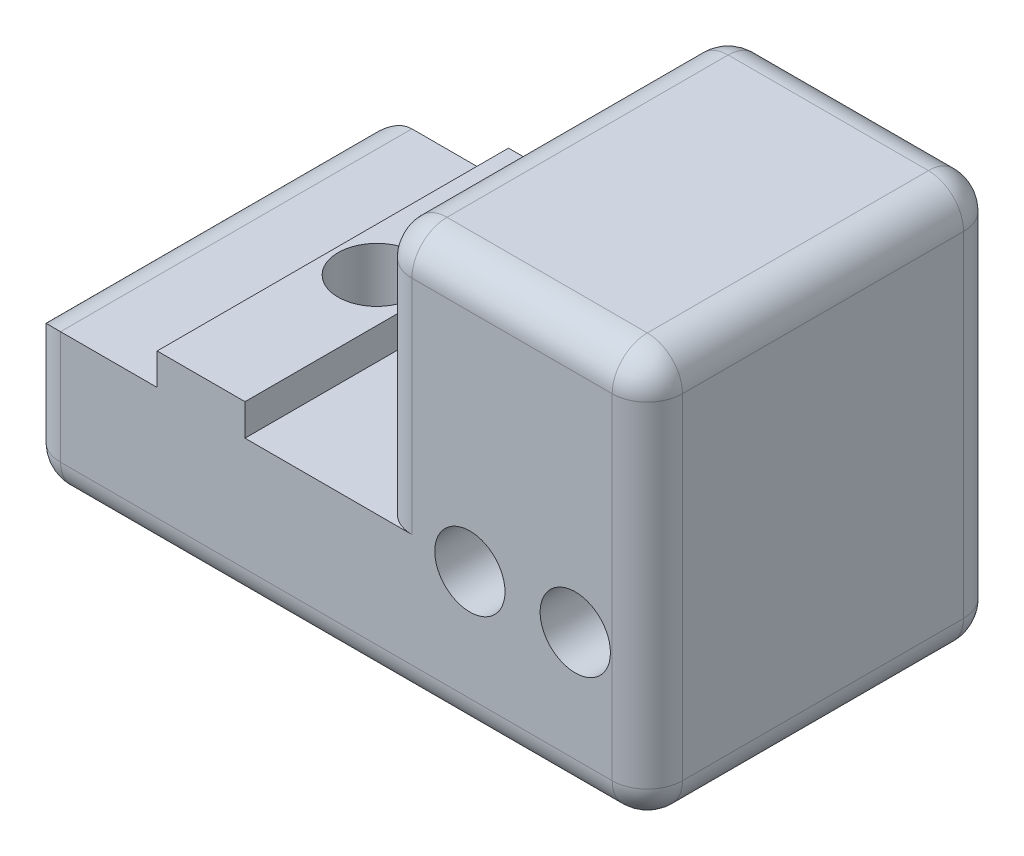
ISO-10303-21;
HEADER;
FILE_DESCRIPTION(('STEP AP214'),'2;1');
FILE_NAME('part.step','',(''),(''),'','','');
FILE_SCHEMA(('AUTOMOTIVE_DESIGN { 1 0 10303 214 1 1 1 1 }'));
ENDSEC;
DATA;
#1=APPLICATION_CONTEXT('core data for automotive mechanical design processes');
#2=APPLICATION_PROTOCOL_DEFINITION('international standard','automotive_design',2000,#1);
#3=PRODUCT_CONTEXT('',#1,'mechanical');
#4=PRODUCT('Part','Part','',(#3));
#5=PRODUCT_RELATED_PRODUCT_CATEGORY('part','',(#4));
#6=PRODUCT_DEFINITION_FORMATION('','',#4);
#7=PRODUCT_DEFINITION_CONTEXT('part definition',#1,'design');
#8=PRODUCT_DEFINITION('design','',#6,#7);
#9=PRODUCT_DEFINITION_SHAPE('','',#8);
#10=(LENGTH_UNIT() NAMED_UNIT(*) SI_UNIT(.MILLI.,.METRE.));
#11=(NAMED_UNIT(*) PLANE_ANGLE_UNIT() SI_UNIT($,.RADIAN.));
#12=(NAMED_UNIT(*) SI_UNIT($,.STERADIAN.) SOLID_ANGLE_UNIT());
#13=UNCERTAINTY_MEASURE_WITH_UNIT(LENGTH_MEASURE(1.E-05),#10,'distance_accuracy_value','');
#14=(GEOMETRIC_REPRESENTATION_CONTEXT(3) GLOBAL_UNCERTAINTY_ASSIGNED_CONTEXT((#13)) GLOBAL_UNIT_ASSIGNED_CONTEXT((#10,
#11,#12)) REPRESENTATION_CONTEXT('',''));
#15=CARTESIAN_POINT('',(0.,0.,0.));
#16=DIRECTION('',(0.,0.,1.));
#17=DIRECTION('',(1.,0.,0.));
#18=AXIS2_PLACEMENT_3D('',#15,#16,#17);
#19=CARTESIAN_POINT('',(-22.3002947508783,-77.3158533897207,20.));
#20=DIRECTION('',(0.,0.,-1.));
#21=DIRECTION('',(-1.,0.,0.));
#22=AXIS2_PLACEMENT_3D('',#19,#20,#21);
#23=CYLINDRICAL_SURFACE('',#22,3.05);
#24=CARTESIAN_POINT('',(-22.3002947508783,-77.3158533897207,0.));
#25=DIRECTION('',(0.,0.,1.));
#26=DIRECTION('',(1.,0.,0.));
#27=AXIS2_PLACEMENT_3D('',#24,#25,#26);
#28=CIRCLE('',#27,3.05);
#29=CARTESIAN_POINT('',(-19.2502947508783,-77.3158533897207,0.));
#30=VERTEX_POINT('',#29);
#31=EDGE_CURVE('E387',#30,#30,#28,.T.);
#32=ORIENTED_EDGE('',*,*,#31,.F.);
#33=EDGE_LOOP('',(#32));
#34=FACE_BOUND('',#33,.T.);
#35=CARTESIAN_POINT('',(-22.3002947508783,-77.3158533897207,6.3));
#36=DIRECTION('',(0.,0.,1.));
#37=DIRECTION('',(1.,0.,0.));
#38=AXIS2_PLACEMENT_3D('',#35,#36,#37);
#39=CIRCLE('',#38,3.05);
#40=CARTESIAN_POINT('',(-19.2502947508783,-77.3158533897207,6.3));
#41=VERTEX_POINT('',#40);
#42=EDGE_CURVE('E368',#41,#41,#39,.T.);
#43=ORIENTED_EDGE('',*,*,#42,.T.);
#44=EDGE_LOOP('',(#43));
#45=FACE_BOUND('',#44,.T.);
#46=ADVANCED_FACE('F38',(#34,#45),#23,.F.);
#47=CARTESIAN_POINT('',(-40.6005895017559,-65.0710515298097,10.));
#48=DIRECTION('',(0.,-1.,0.));
#49=DIRECTION('',(0.,0.,-1.));
#50=AXIS2_PLACEMENT_3D('',#47,#48,#49);
#51=CYLINDRICAL_SURFACE('',#50,2.2);
#52=CARTESIAN_POINT('',(-40.6005895017559,-82.343339933083,10.));
#53=DIRECTION('',(0.,-1.,0.));
#54=DIRECTION('',(0.,0.,-1.));
#55=AXIS2_PLACEMENT_3D('',#52,#53,#54);
#56=CIRCLE('',#55,2.2);
#57=CARTESIAN_POINT('',(-40.6005895017559,-82.343339933083,7.8));
#58=VERTEX_POINT('',#57);
#59=EDGE_CURVE('E384',#58,#58,#56,.T.);
#60=ORIENTED_EDGE('',*,*,#59,.F.);
#61=EDGE_LOOP('',(#60));
#62=FACE_BOUND('',#61,.T.);
#63=CARTESIAN_POINT('',(-40.6005895017559,-86.1433399330828,10.));
#64=DIRECTION('',(0.,-1.,0.));
#65=DIRECTION('',(0.,0.,-1.));
#66=AXIS2_PLACEMENT_3D('',#63,#64,#65);
#67=CIRCLE('',#66,2.2);
#68=CARTESIAN_POINT('',(-40.6005895017559,-86.1433399330828,7.8));
#69=VERTEX_POINT('',#68);
#70=EDGE_CURVE('E380',#69,#69,#67,.F.);
#71=ORIENTED_EDGE('',*,*,#70,.F.);
#72=EDGE_LOOP('',(#71));
#73=FACE_BOUND('',#72,.T.);
#74=ADVANCED_FACE('F421',(#62,#73),#51,.F.);
#75=CARTESIAN_POINT('',(0.,0.,20.));
#76=DIRECTION('',(0.,0.,-1.));
#77=DIRECTION('',(-1.,0.,0.));
#78=AXIS2_PLACEMENT_3D('',#75,#76,#77);
#79=PLANE('',#78);
#80=DIRECTION('',(0.,-1.,0.));
#81=VECTOR('',#80,1.);
#82=CARTESIAN_POINT('',(-28.6005895017601,0.,20.));
#83=LINE('',#82,#81);
#84=CARTESIAN_POINT('',(-28.6005895017601,-71.5033399330828,20.));
#85=VERTEX_POINT('',#84);
#86=CARTESIAN_POINT('',(-28.6005895017601,-84.1433399330828,20.));
#87=VERTEX_POINT('',#86);
#88=EDGE_CURVE('E186',#85,#87,#83,.T.);
#89=ORIENTED_EDGE('',*,*,#88,.T.);
#90=DIRECTION('',(-1.,0.,0.));
#91=VECTOR('',#90,1.);
#92=CARTESIAN_POINT('',(-38.1005895017562,-84.1433399330828,20.));
#93=LINE('',#92,#91);
#94=CARTESIAN_POINT('',(-38.1005895017562,-84.1433399330828,20.));
#95=VERTEX_POINT('',#94);
#96=EDGE_CURVE('E178',#87,#95,#93,.T.);
#97=ORIENTED_EDGE('',*,*,#96,.T.);
#98=DIRECTION('',(0.,1.,0.));
#99=VECTOR('',#98,1.);
#100=CARTESIAN_POINT('',(-38.1005895017562,-84.1433399330828,20.));
#101=LINE('',#100,#99);
#102=CARTESIAN_POINT('',(-38.1005895017562,-82.343339933083,20.));
#103=VERTEX_POINT('',#102);
#104=EDGE_CURVE('E183',#95,#103,#101,.T.);
#105=ORIENTED_EDGE('',*,*,#104,.T.);
#106=DIRECTION('',(-1.,0.,0.));
#107=VECTOR('',#106,1.);
#108=CARTESIAN_POINT('',(-43.1005895017562,-82.343339933083,20.));
#109=LINE('',#108,#107);
#110=CARTESIAN_POINT('',(-43.1005895017562,-82.343339933083,20.));
#111=VERTEX_POINT('',#110);
#112=EDGE_CURVE('E204',#103,#111,#109,.T.);
#113=ORIENTED_EDGE('',*,*,#112,.T.);
#114=DIRECTION('',(0.,-1.,0.));
#115=VECTOR('',#114,1.);
#116=CARTESIAN_POINT('',(-43.1005895017562,-84.1433399330828,20.));
#117=LINE('',#116,#115);
#118=CARTESIAN_POINT('',(-43.1005895017562,-84.1433399330828,20.));
#119=VERTEX_POINT('',#118);
#120=EDGE_CURVE('E206',#111,#119,#117,.T.);
#121=ORIENTED_EDGE('',*,*,#120,.T.);
#122=DIRECTION('',(-1.,0.,0.));
#123=VECTOR('',#122,1.);
#124=CARTESIAN_POINT('',(-50.6005895017559,-84.1433399330828,20.));
#125=LINE('',#124,#123);
#126=CARTESIAN_POINT('',(-48.6005895017559,-84.1433399330828,20.));
#127=VERTEX_POINT('',#126);
#128=EDGE_CURVE('E211',#119,#127,#125,.T.);
#129=ORIENTED_EDGE('',*,*,#128,.T.);
#130=DIRECTION('',(0.,-1.,0.));
#131=VECTOR('',#130,1.);
#132=CARTESIAN_POINT('',(-48.6005895017559,0.,20.));
#133=LINE('',#132,#131);
#134=CARTESIAN_POINT('',(-48.6005895017559,-90.5790515298097,20.));
#135=VERTEX_POINT('',#134);
#136=EDGE_CURVE('E252',#127,#135,#133,.T.);
#137=ORIENTED_EDGE('',*,*,#136,.T.);
#138=DIRECTION('',(1.,0.,0.));
#139=VECTOR('',#138,1.);
#140=CARTESIAN_POINT('',(0.,-90.5790515298097,20.));
#141=LINE('',#140,#139);
#142=CARTESIAN_POINT('',(-17.2000000000001,-90.5790515298097,20.));
#143=VERTEX_POINT('',#142);
#144=EDGE_CURVE('E249',#135,#143,#141,.T.);
#145=ORIENTED_EDGE('',*,*,#144,.T.);
#146=DIRECTION('',(0.,1.,0.));
#147=VECTOR('',#146,1.);
#148=CARTESIAN_POINT('',(-17.2000000000001,0.,20.));
#149=LINE('',#148,#147);
#150=CARTESIAN_POINT('',(-17.2000000000001,-71.5033399330828,20.));
#151=VERTEX_POINT('',#150);
#152=EDGE_CURVE('E245',#143,#151,#149,.T.);
#153=ORIENTED_EDGE('',*,*,#152,.T.);
#154=DIRECTION('',(-1.,0.,0.));
#155=VECTOR('',#154,1.);
#156=CARTESIAN_POINT('',(0.,-71.5033399330828,20.));
#157=LINE('',#156,#155);
#158=EDGE_CURVE('E247',#151,#85,#157,.T.);
#159=ORIENTED_EDGE('',*,*,#158,.T.);
#160=EDGE_LOOP('',(#89,#97,#105,#113,#121,#129,#137,#145,#153,#159));
#161=FACE_BOUND('',#160,.T.);
#162=CARTESIAN_POINT('',(-25.3002947508783,-84.3158533897207,20.));
#163=DIRECTION('',(0.,0.,1.));
#164=DIRECTION('',(1.,0.,0.));
#165=AXIS2_PLACEMENT_3D('',#162,#163,#164);
#166=CIRCLE('',#165,2.);
#167=CARTESIAN_POINT('',(-23.3002947508783,-84.3158533897207,20.));
#168=VERTEX_POINT('',#167);
#169=EDGE_CURVE('E217',#168,#168,#166,.T.);
#170=ORIENTED_EDGE('',*,*,#169,.F.);
#171=EDGE_LOOP('',(#170));
#172=FACE_BOUND('',#171,.T.);
#173=CARTESIAN_POINT('',(-19.3002947508783,-84.3158533897207,20.));
#174=DIRECTION('',(0.,0.,1.));
#175=DIRECTION('',(1.,0.,0.));
#176=AXIS2_PLACEMENT_3D('',#173,#174,#175);
#177=CIRCLE('',#176,2.);
#178=CARTESIAN_POINT('',(-17.3002947508783,-84.3158533897207,20.));
#179=VERTEX_POINT('',#178);
#180=EDGE_CURVE('E391',#179,#179,#177,.T.);
#181=ORIENTED_EDGE('',*,*,#180,.F.);
#182=EDGE_LOOP('',(#181));
#183=FACE_BOUND('',#182,.T.);
#184=ADVANCED_FACE('F180',(#161,#172,#183),#79,.F.);
#185=CARTESIAN_POINT('',(0.,0.,0.));
#186=DIRECTION('',(0.,0.,-1.));
#187=DIRECTION('',(-1.,0.,0.));
#188=AXIS2_PLACEMENT_3D('',#185,#186,#187);
#189=PLANE('',#188);
#190=CARTESIAN_POINT('',(-19.3002947508783,-84.3158533897207,0.));
#191=DIRECTION('',(0.,0.,1.));
#192=DIRECTION('',(1.,0.,0.));
#193=AXIS2_PLACEMENT_3D('',#190,#191,#192);
#194=CIRCLE('',#193,2.);
#195=CARTESIAN_POINT('',(-17.3002947508783,-84.3158533897207,0.));
#196=VERTEX_POINT('',#195);
#197=EDGE_CURVE('E390',#196,#196,#194,.T.);
#198=ORIENTED_EDGE('',*,*,#197,.T.);
#199=EDGE_LOOP('',(#198));
#200=FACE_BOUND('',#199,.T.);
#201=DIRECTION('',(1.,0.,0.));
#202=VECTOR('',#201,1.);
#203=CARTESIAN_POINT('',(-50.6005895017559,-90.5790515298097,0.));
#204=LINE('',#203,#202);
#205=CARTESIAN_POINT('',(-17.2000000000001,-90.5790515298097,0.));
#206=VERTEX_POINT('',#205);
#207=CARTESIAN_POINT('',(-48.6005895017559,-90.5790515298097,0.));
#208=VERTEX_POINT('',#207);
#209=EDGE_CURVE('E254',#206,#208,#204,.F.);
#210=ORIENTED_EDGE('',*,*,#209,.T.);
#211=DIRECTION('',(0.,-1.,0.));
#212=VECTOR('',#211,1.);
#213=CARTESIAN_POINT('',(-48.6005895017559,-84.1433399330828,0.));
#214=LINE('',#213,#212);
#215=CARTESIAN_POINT('',(-48.6005895017559,-84.1433399330828,0.));
#216=VERTEX_POINT('',#215);
#217=EDGE_CURVE('E262',#208,#216,#214,.F.);
#218=ORIENTED_EDGE('',*,*,#217,.T.);
#219=DIRECTION('',(-1.,0.,0.));
#220=VECTOR('',#219,1.);
#221=CARTESIAN_POINT('',(-50.6005895017559,-84.1433399330828,0.));
#222=LINE('',#221,#220);
#223=CARTESIAN_POINT('',(-43.1005895017562,-84.1433399330828,0.));
#224=VERTEX_POINT('',#223);
#225=EDGE_CURVE('E189',#224,#216,#222,.T.);
#226=ORIENTED_EDGE('',*,*,#225,.F.);
#227=DIRECTION('',(0.,-1.,0.));
#228=VECTOR('',#227,1.);
#229=CARTESIAN_POINT('',(-43.1005895017562,-84.1433399330828,0.));
#230=LINE('',#229,#228);
#231=CARTESIAN_POINT('',(-43.1005895017562,-82.343339933083,0.));
#232=VERTEX_POINT('',#231);
#233=EDGE_CURVE('E221',#232,#224,#230,.T.);
#234=ORIENTED_EDGE('',*,*,#233,.F.);
#235=DIRECTION('',(-1.,0.,0.));
#236=VECTOR('',#235,1.);
#237=CARTESIAN_POINT('',(-43.1005895017562,-82.343339933083,0.));
#238=LINE('',#237,#236);
#239=CARTESIAN_POINT('',(-38.1005895017562,-82.343339933083,0.));
#240=VERTEX_POINT('',#239);
#241=EDGE_CURVE('E219',#240,#232,#238,.T.);
#242=ORIENTED_EDGE('',*,*,#241,.F.);
#243=DIRECTION('',(0.,1.,0.));
#244=VECTOR('',#243,1.);
#245=CARTESIAN_POINT('',(-38.1005895017562,-84.1433399330828,0.));
#246=LINE('',#245,#244);
#247=CARTESIAN_POINT('',(-38.1005895017562,-84.1433399330828,0.));
#248=VERTEX_POINT('',#247);
#249=EDGE_CURVE('E216',#248,#240,#246,.T.);
#250=ORIENTED_EDGE('',*,*,#249,.F.);
#251=DIRECTION('',(-1.,0.,0.));
#252=VECTOR('',#251,1.);
#253=CARTESIAN_POINT('',(-38.1005895017562,-84.1433399330828,0.));
#254=LINE('',#253,#252);
#255=CARTESIAN_POINT('',(-28.6005895017601,-84.1433399330828,0.));
#256=VERTEX_POINT('',#255);
#257=EDGE_CURVE('E195',#256,#248,#254,.T.);
#258=ORIENTED_EDGE('',*,*,#257,.F.);
#259=DIRECTION('',(0.,-1.,0.));
#260=VECTOR('',#259,1.);
#261=CARTESIAN_POINT('',(-28.6005895017601,-69.5033399330828,0.));
#262=LINE('',#261,#260);
#263=CARTESIAN_POINT('',(-28.6005895017601,-71.5033399330828,0.));
#264=VERTEX_POINT('',#263);
#265=EDGE_CURVE('E260',#256,#264,#262,.F.);
#266=ORIENTED_EDGE('',*,*,#265,.T.);
#267=DIRECTION('',(-1.,0.,0.));
#268=VECTOR('',#267,1.);
#269=CARTESIAN_POINT('',(-15.2000000000001,-71.5033399330828,0.));
#270=LINE('',#269,#268);
#271=CARTESIAN_POINT('',(-17.2000000000001,-71.5033399330828,0.));
#272=VERTEX_POINT('',#271);
#273=EDGE_CURVE('E258',#264,#272,#270,.F.);
#274=ORIENTED_EDGE('',*,*,#273,.T.);
#275=DIRECTION('',(0.,1.,0.));
#276=VECTOR('',#275,1.);
#277=CARTESIAN_POINT('',(-17.2000000000001,-92.5790515298097,0.));
#278=LINE('',#277,#276);
#279=EDGE_CURVE('E256',#272,#206,#278,.F.);
#280=ORIENTED_EDGE('',*,*,#279,.T.);
#281=EDGE_LOOP('',(#210,#218,#226,#234,#242,#250,#258,#266,#274,#280));
#282=FACE_BOUND('',#281,.T.);
#283=CARTESIAN_POINT('',(-25.3002947508783,-84.3158533897207,0.));
#284=DIRECTION('',(0.,0.,1.));
#285=DIRECTION('',(1.,0.,0.));
#286=AXIS2_PLACEMENT_3D('',#283,#284,#285);
#287=CIRCLE('',#286,2.);
#288=CARTESIAN_POINT('',(-23.3002947508783,-84.3158533897207,0.));
#289=VERTEX_POINT('',#288);
#290=EDGE_CURVE('E394',#289,#289,#287,.T.);
#291=ORIENTED_EDGE('',*,*,#290,.T.);
#292=EDGE_LOOP('',(#291));
#293=FACE_BOUND('',#292,.T.);
#294=ORIENTED_EDGE('',*,*,#31,.T.);
#295=EDGE_LOOP('',(#294));
#296=FACE_BOUND('',#295,.T.);
#297=ADVANCED_FACE('F401',(#200,#282,#293,#296),#189,.T.);
#298=CARTESIAN_POINT('',(-15.2000000000001,-92.5790515298097,20.));
#299=DIRECTION('',(-1.,0.,0.));
#300=DIRECTION('',(0.,0.,1.));
#301=AXIS2_PLACEMENT_3D('',#298,#299,#300);
#302=PLANE('',#301);
#303=DIRECTION('',(0.,1.,0.));
#304=VECTOR('',#303,1.);
#305=CARTESIAN_POINT('',(-15.2000000000001,-69.5033399330828,2.));
#306=LINE('',#305,#304);
#307=CARTESIAN_POINT('',(-15.2000000000001,-90.5790515298097,2.));
#308=VERTEX_POINT('',#307);
#309=CARTESIAN_POINT('',(-15.2000000000001,-71.5033399330828,2.));
#310=VERTEX_POINT('',#309);
#311=EDGE_CURVE('E283',#308,#310,#306,.T.);
#312=ORIENTED_EDGE('',*,*,#311,.T.);
#313=DIRECTION('',(0.,0.,-1.));
#314=VECTOR('',#313,1.);
#315=CARTESIAN_POINT('',(-15.2000000000001,-71.5033399330828,20.));
#316=LINE('',#315,#314);
#317=CARTESIAN_POINT('',(-15.2000000000001,-71.5033399330828,18.));
#318=VERTEX_POINT('',#317);
#319=EDGE_CURVE('E285',#310,#318,#316,.F.);
#320=ORIENTED_EDGE('',*,*,#319,.T.);
#321=DIRECTION('',(0.,1.,0.));
#322=VECTOR('',#321,1.);
#323=CARTESIAN_POINT('',(-15.2000000000001,-92.5790515298097,18.));
#324=LINE('',#323,#322);
#325=CARTESIAN_POINT('',(-15.2000000000001,-90.5790515298097,18.));
#326=VERTEX_POINT('',#325);
#327=EDGE_CURVE('E281',#318,#326,#324,.F.);
#328=ORIENTED_EDGE('',*,*,#327,.T.);
#329=DIRECTION('',(0.,0.,-1.));
#330=VECTOR('',#329,1.);
#331=CARTESIAN_POINT('',(-15.2000000000001,-90.5790515298097,20.));
#332=LINE('',#331,#330);
#333=EDGE_CURVE('E279',#326,#308,#332,.T.);
#334=ORIENTED_EDGE('',*,*,#333,.T.);
#335=EDGE_LOOP('',(#312,#320,#328,#334));
#336=FACE_BOUND('',#335,.T.);
#337=ADVANCED_FACE('F683',(#336),#302,.F.);
#338=CARTESIAN_POINT('',(-30.6005895017601,-69.5033399330828,20.));
#339=DIRECTION('',(0.,-1.,0.));
#340=DIRECTION('',(0.,0.,-1.));
#341=AXIS2_PLACEMENT_3D('',#338,#339,#340);
#342=PLANE('',#341);
#343=DIRECTION('',(-1.,0.,0.));
#344=VECTOR('',#343,1.);
#345=CARTESIAN_POINT('',(-30.6005895017601,-69.5033399330828,2.));
#346=LINE('',#345,#344);
#347=CARTESIAN_POINT('',(-17.2000000000001,-69.5033399330828,2.));
#348=VERTEX_POINT('',#347);
#349=CARTESIAN_POINT('',(-28.6005895017601,-69.5033399330828,2.));
#350=VERTEX_POINT('',#349);
#351=EDGE_CURVE('E274',#348,#350,#346,.T.);
#352=ORIENTED_EDGE('',*,*,#351,.T.);
#353=DIRECTION('',(0.,0.,-1.));
#354=VECTOR('',#353,1.);
#355=CARTESIAN_POINT('',(-28.6005895017601,-69.5033399330828,20.));
#356=LINE('',#355,#354);
#357=CARTESIAN_POINT('',(-28.6005895017601,-69.5033399330828,18.));
#358=VERTEX_POINT('',#357);
#359=EDGE_CURVE('E276',#350,#358,#356,.F.);
#360=ORIENTED_EDGE('',*,*,#359,.T.);
#361=DIRECTION('',(-1.,0.,0.));
#362=VECTOR('',#361,1.);
#363=CARTESIAN_POINT('',(-30.6005895017601,-69.5033399330828,18.));
#364=LINE('',#363,#362);
#365=CARTESIAN_POINT('',(-17.2000000000001,-69.5033399330828,18.));
#366=VERTEX_POINT('',#365);
#367=EDGE_CURVE('E270',#358,#366,#364,.F.);
#368=ORIENTED_EDGE('',*,*,#367,.T.);
#369=DIRECTION('',(0.,0.,-1.));
#370=VECTOR('',#369,1.);
#371=CARTESIAN_POINT('',(-17.2000000000001,-69.5033399330828,20.));
#372=LINE('',#371,#370);
#373=EDGE_CURVE('E272',#366,#348,#372,.T.);
#374=ORIENTED_EDGE('',*,*,#373,.T.);
#375=EDGE_LOOP('',(#352,#360,#368,#374));
#376=FACE_BOUND('',#375,.T.);
#377=ADVANCED_FACE('F686',(#376),#342,.F.);
#378=CARTESIAN_POINT('',(-30.6005895017601,-84.1433399330828,20.));
#379=DIRECTION('',(1.,0.,0.));
#380=DIRECTION('',(0.,0.,-1.));
#381=AXIS2_PLACEMENT_3D('',#378,#379,#380);
#382=PLANE('',#381);
#383=DIRECTION('',(0.,0.,-1.));
#384=VECTOR('',#383,1.);
#385=CARTESIAN_POINT('',(-30.6005895017601,-71.5033399330828,20.));
#386=LINE('',#385,#384);
#387=CARTESIAN_POINT('',(-30.6005895017601,-71.5033399330828,18.));
#388=VERTEX_POINT('',#387);
#389=CARTESIAN_POINT('',(-30.6005895017601,-71.5033399330828,2.));
#390=VERTEX_POINT('',#389);
#391=EDGE_CURVE('E264',#388,#390,#386,.T.);
#392=ORIENTED_EDGE('',*,*,#391,.T.);
#393=DIRECTION('',(0.,-1.,0.));
#394=VECTOR('',#393,1.);
#395=CARTESIAN_POINT('',(-30.6005895017601,-84.1433399330828,2.));
#396=LINE('',#395,#394);
#397=CARTESIAN_POINT('',(-30.6005895017601,-84.1433399330828,2.));
#398=VERTEX_POINT('',#397);
#399=EDGE_CURVE('E268',#390,#398,#396,.T.);
#400=ORIENTED_EDGE('',*,*,#399,.T.);
#401=DIRECTION('',(0.,0.,-1.));
#402=VECTOR('',#401,1.);
#403=CARTESIAN_POINT('',(-30.6005895017601,-84.1433399330828,20.));
#404=LINE('',#403,#402);
#405=CARTESIAN_POINT('',(-30.6005895017601,-84.1433399330828,18.));
#406=VERTEX_POINT('',#405);
#407=EDGE_CURVE('E198',#406,#398,#404,.T.);
#408=ORIENTED_EDGE('',*,*,#407,.F.);
#409=DIRECTION('',(0.,-1.,0.));
#410=VECTOR('',#409,1.);
#411=CARTESIAN_POINT('',(-30.6005895017601,-84.1433399330828,18.));
#412=LINE('',#411,#410);
#413=EDGE_CURVE('E266',#406,#388,#412,.F.);
#414=ORIENTED_EDGE('',*,*,#413,.T.);
#415=EDGE_LOOP('',(#392,#400,#408,#414));
#416=FACE_BOUND('',#415,.T.);
#417=ADVANCED_FACE('F455',(#416),#382,.F.);
#418=CARTESIAN_POINT('',(-38.1005895017562,-84.1433399330828,20.));
#419=DIRECTION('',(0.,-1.,0.));
#420=DIRECTION('',(0.,0.,-1.));
#421=AXIS2_PLACEMENT_3D('',#418,#419,#420);
#422=PLANE('',#421);
#423=ORIENTED_EDGE('',*,*,#257,.T.);
#424=DIRECTION('',(0.,0.,-1.));
#425=VECTOR('',#424,1.);
#426=CARTESIAN_POINT('',(-38.1005895017562,-84.1433399330828,20.));
#427=LINE('',#426,#425);
#428=EDGE_CURVE('E192',#95,#248,#427,.T.);
#429=ORIENTED_EDGE('',*,*,#428,.F.);
#430=ORIENTED_EDGE('',*,*,#96,.F.);
#431=CARTESIAN_POINT('',(-28.6005895017601,-84.1433399330828,18.));
#432=DIRECTION('',(0.,-1.,0.));
#433=DIRECTION('',(0.,0.,-1.));
#434=AXIS2_PLACEMENT_3D('',#431,#432,#433);
#435=CIRCLE('',#434,2.);
#436=EDGE_CURVE('E13',#87,#406,#435,.T.);
#437=ORIENTED_EDGE('',*,*,#436,.T.);
#438=ORIENTED_EDGE('',*,*,#407,.T.);
#439=CARTESIAN_POINT('',(-28.6005895017601,-84.1433399330828,2.));
#440=DIRECTION('',(0.,-1.,0.));
#441=DIRECTION('',(0.,0.,-1.));
#442=AXIS2_PLACEMENT_3D('',#439,#440,#441);
#443=CIRCLE('',#442,2.);
#444=EDGE_CURVE('E47',#398,#256,#443,.T.);
#445=ORIENTED_EDGE('',*,*,#444,.T.);
#446=EDGE_LOOP('',(#423,#429,#430,#437,#438,#445));
#447=FACE_BOUND('',#446,.T.);
#448=ADVANCED_FACE('F193',(#447),#422,.F.);
#449=CARTESIAN_POINT('',(-38.1005895017562,-84.1433399330828,20.));
#450=DIRECTION('',(-1.,0.,0.));
#451=DIRECTION('',(0.,0.,1.));
#452=AXIS2_PLACEMENT_3D('',#449,#450,#451);
#453=PLANE('',#452);
#454=ORIENTED_EDGE('',*,*,#249,.T.);
#455=DIRECTION('',(0.,0.,-1.));
#456=VECTOR('',#455,1.);
#457=CARTESIAN_POINT('',(-38.1005895017562,-82.343339933083,20.));
#458=LINE('',#457,#456);
#459=EDGE_CURVE('E199',#103,#240,#458,.T.);
#460=ORIENTED_EDGE('',*,*,#459,.F.);
#461=ORIENTED_EDGE('',*,*,#104,.F.);
#462=ORIENTED_EDGE('',*,*,#428,.T.);
#463=EDGE_LOOP('',(#454,#460,#461,#462));
#464=FACE_BOUND('',#463,.T.);
#465=ADVANCED_FACE('F201',(#464),#453,.F.);
#466=CARTESIAN_POINT('',(-43.1005895017562,-82.343339933083,20.));
#467=DIRECTION('',(0.,-1.,0.));
#468=DIRECTION('',(0.,0.,-1.));
#469=AXIS2_PLACEMENT_3D('',#466,#467,#468);
#470=PLANE('',#469);
#471=ORIENTED_EDGE('',*,*,#59,.T.);
#472=EDGE_LOOP('',(#471));
#473=FACE_BOUND('',#472,.T.);
#474=ORIENTED_EDGE('',*,*,#241,.T.);
#475=DIRECTION('',(0.,0.,-1.));
#476=VECTOR('',#475,1.);
#477=CARTESIAN_POINT('',(-43.1005895017562,-82.343339933083,20.));
#478=LINE('',#477,#476);
#479=EDGE_CURVE('E227',#111,#232,#478,.T.);
#480=ORIENTED_EDGE('',*,*,#479,.F.);
#481=ORIENTED_EDGE('',*,*,#112,.F.);
#482=ORIENTED_EDGE('',*,*,#459,.T.);
#483=EDGE_LOOP('',(#474,#480,#481,#482));
#484=FACE_BOUND('',#483,.T.);
#485=ADVANCED_FACE('F478',(#473,#484),#470,.F.);
#486=CARTESIAN_POINT('',(-43.1005895017562,-84.1433399330828,20.));
#487=DIRECTION('',(1.,0.,0.));
#488=DIRECTION('',(0.,0.,-1.));
#489=AXIS2_PLACEMENT_3D('',#486,#487,#488);
#490=PLANE('',#489);
#491=ORIENTED_EDGE('',*,*,#233,.T.);
#492=DIRECTION('',(0.,0.,-1.));
#493=VECTOR('',#492,1.);
#494=CARTESIAN_POINT('',(-43.1005895017562,-84.1433399330828,20.));
#495=LINE('',#494,#493);
#496=EDGE_CURVE('E214',#119,#224,#495,.T.);
#497=ORIENTED_EDGE('',*,*,#496,.F.);
#498=ORIENTED_EDGE('',*,*,#120,.F.);
#499=ORIENTED_EDGE('',*,*,#479,.T.);
#500=EDGE_LOOP('',(#491,#497,#498,#499));
#501=FACE_BOUND('',#500,.T.);
#502=ADVANCED_FACE('F484',(#501),#490,.F.);
#503=CARTESIAN_POINT('',(-50.6005895017559,-84.1433399330828,20.));
#504=DIRECTION('',(0.,-1.,0.));
#505=DIRECTION('',(0.,0.,-1.));
#506=AXIS2_PLACEMENT_3D('',#503,#504,#505);
#507=PLANE('',#506);
#508=ORIENTED_EDGE('',*,*,#225,.T.);
#509=DIRECTION('',(0.,0.,-1.));
#510=VECTOR('',#509,1.);
#511=CARTESIAN_POINT('',(-48.6005895017559,-84.1433399330828,20.));
#512=LINE('',#511,#510);
#513=EDGE_CURVE('E242',#216,#127,#512,.F.);
#514=ORIENTED_EDGE('',*,*,#513,.T.);
#515=ORIENTED_EDGE('',*,*,#128,.F.);
#516=ORIENTED_EDGE('',*,*,#496,.T.);
#517=EDGE_LOOP('',(#508,#514,#515,#516));
#518=FACE_BOUND('',#517,.T.);
#519=ADVANCED_FACE('F487',(#518),#507,.F.);
#520=CARTESIAN_POINT('',(-50.6005895017559,-92.5790515298097,20.));
#521=DIRECTION('',(1.,0.,0.));
#522=DIRECTION('',(0.,0.,-1.));
#523=AXIS2_PLACEMENT_3D('',#520,#521,#522);
#524=PLANE('',#523);
#525=DIRECTION('',(0.,-1.,0.));
#526=VECTOR('',#525,1.);
#527=CARTESIAN_POINT('',(-50.6005895017559,-92.5790515298097,18.));
#528=LINE('',#527,#526);
#529=CARTESIAN_POINT('',(-50.6005895017559,-90.5790515298097,18.));
#530=VERTEX_POINT('',#529);
#531=CARTESIAN_POINT('',(-50.6005895017559,-86.1433399330828,18.));
#532=VERTEX_POINT('',#531);
#533=EDGE_CURVE('E237',#530,#532,#528,.F.);
#534=ORIENTED_EDGE('',*,*,#533,.T.);
#535=DIRECTION('',(0.,0.,-1.));
#536=VECTOR('',#535,1.);
#537=CARTESIAN_POINT('',(-50.6005895017559,-86.1433399330828,20.));
#538=LINE('',#537,#536);
#539=CARTESIAN_POINT('',(-50.6005895017559,-86.1433399330828,2.));
#540=VERTEX_POINT('',#539);
#541=EDGE_CURVE('E239',#532,#540,#538,.T.);
#542=ORIENTED_EDGE('',*,*,#541,.T.);
#543=DIRECTION('',(0.,-1.,0.));
#544=VECTOR('',#543,1.);
#545=CARTESIAN_POINT('',(-50.6005895017559,-92.5790515298097,2.));
#546=LINE('',#545,#544);
#547=CARTESIAN_POINT('',(-50.6005895017559,-90.5790515298097,2.));
#548=VERTEX_POINT('',#547);
#549=EDGE_CURVE('E235',#540,#548,#546,.T.);
#550=ORIENTED_EDGE('',*,*,#549,.T.);
#551=DIRECTION('',(0.,0.,-1.));
#552=VECTOR('',#551,1.);
#553=CARTESIAN_POINT('',(-50.6005895017559,-90.5790515298097,20.));
#554=LINE('',#553,#552);
#555=EDGE_CURVE('E233',#548,#530,#554,.F.);
#556=ORIENTED_EDGE('',*,*,#555,.T.);
#557=EDGE_LOOP('',(#534,#542,#550,#556));
#558=FACE_BOUND('',#557,.T.);
#559=ADVANCED_FACE('F417',(#558),#524,.F.);
#560=CARTESIAN_POINT('',(-15.2000000000001,-92.5790515298097,20.));
#561=DIRECTION('',(0.,1.,0.));
#562=DIRECTION('',(0.,0.,1.));
#563=AXIS2_PLACEMENT_3D('',#560,#561,#562);
#564=PLANE('',#563);
#565=DIRECTION('',(1.,0.,0.));
#566=VECTOR('',#565,1.);
#567=CARTESIAN_POINT('',(-15.2000000000001,-92.5790515298097,2.));
#568=LINE('',#567,#566);
#569=CARTESIAN_POINT('',(-48.6005895017559,-92.5790515298097,2.));
#570=VERTEX_POINT('',#569);
#571=CARTESIAN_POINT('',(-17.2000000000001,-92.5790515298097,2.));
#572=VERTEX_POINT('',#571);
#573=EDGE_CURVE('E292',#570,#572,#568,.T.);
#574=ORIENTED_EDGE('',*,*,#573,.T.);
#575=DIRECTION('',(0.,0.,-1.));
#576=VECTOR('',#575,1.);
#577=CARTESIAN_POINT('',(-17.2000000000001,-92.5790515298097,20.));
#578=LINE('',#577,#576);
#579=CARTESIAN_POINT('',(-17.2000000000001,-92.5790515298097,18.));
#580=VERTEX_POINT('',#579);
#581=EDGE_CURVE('E63',#572,#580,#578,.F.);
#582=ORIENTED_EDGE('',*,*,#581,.T.);
#583=DIRECTION('',(1.,0.,0.));
#584=VECTOR('',#583,1.);
#585=CARTESIAN_POINT('',(-15.2000000000001,-92.5790515298097,18.));
#586=LINE('',#585,#584);
#587=CARTESIAN_POINT('',(-48.6005895017559,-92.5790515298097,18.));
#588=VERTEX_POINT('',#587);
#589=EDGE_CURVE('E290',#580,#588,#586,.F.);
#590=ORIENTED_EDGE('',*,*,#589,.T.);
#591=DIRECTION('',(0.,0.,-1.));
#592=VECTOR('',#591,1.);
#593=CARTESIAN_POINT('',(-48.6005895017559,-92.5790515298097,20.));
#594=LINE('',#593,#592);
#595=EDGE_CURVE('E288',#588,#570,#594,.T.);
#596=ORIENTED_EDGE('',*,*,#595,.T.);
#597=EDGE_LOOP('',(#574,#582,#590,#596));
#598=FACE_BOUND('',#597,.T.);
#599=CARTESIAN_POINT('',(-40.6005895017559,-92.5790515298097,10.));
#600=DIRECTION('',(0.,-1.,0.));
#601=DIRECTION('',(0.,0.,-1.));
#602=AXIS2_PLACEMENT_3D('',#599,#600,#601);
#603=CIRCLE('',#602,3.7);
#604=CARTESIAN_POINT('',(-40.6005895017559,-92.5790515298097,6.3));
#605=VERTEX_POINT('',#604);
#606=EDGE_CURVE('E371',#605,#605,#603,.T.);
#607=ORIENTED_EDGE('',*,*,#606,.F.);
#608=EDGE_LOOP('',(#607));
#609=FACE_BOUND('',#608,.T.);
#610=ADVANCED_FACE('F407',(#598,#609),#564,.F.);
#611=CARTESIAN_POINT('',(-25.3002947508783,-84.3158533897207,20.));
#612=DIRECTION('',(0.,0.,-1.));
#613=DIRECTION('',(-1.,0.,0.));
#614=AXIS2_PLACEMENT_3D('',#611,#612,#613);
#615=CYLINDRICAL_SURFACE('',#614,2.);
#616=ORIENTED_EDGE('',*,*,#169,.T.);
#617=EDGE_LOOP('',(#616));
#618=FACE_BOUND('',#617,.T.);
#619=ORIENTED_EDGE('',*,*,#290,.F.);
#620=EDGE_LOOP('',(#619));
#621=FACE_BOUND('',#620,.T.);
#622=ADVANCED_FACE('F404',(#618,#621),#615,.F.);
#623=CARTESIAN_POINT('',(-19.3002947508783,-84.3158533897207,20.));
#624=DIRECTION('',(0.,0.,-1.));
#625=DIRECTION('',(-1.,0.,0.));
#626=AXIS2_PLACEMENT_3D('',#623,#624,#625);
#627=CYLINDRICAL_SURFACE('',#626,2.);
#628=ORIENTED_EDGE('',*,*,#180,.T.);
#629=EDGE_LOOP('',(#628));
#630=FACE_BOUND('',#629,.T.);
#631=ORIENTED_EDGE('',*,*,#197,.F.);
#632=EDGE_LOOP('',(#631));
#633=FACE_BOUND('',#632,.T.);
#634=ADVANCED_FACE('F406',(#630,#633),#627,.F.);
#635=CARTESIAN_POINT('',(-40.6005895017559,-73.6781595715219,10.));
#636=DIRECTION('',(0.,-1.,0.));
#637=DIRECTION('',(0.,0.,-1.));
#638=AXIS2_PLACEMENT_3D('',#635,#636,#637);
#639=CYLINDRICAL_SURFACE('',#638,3.7);
#640=CARTESIAN_POINT('',(-40.6005895017559,-86.1433399330828,10.));
#641=DIRECTION('',(0.,-1.,0.));
#642=DIRECTION('',(0.,0.,-1.));
#643=AXIS2_PLACEMENT_3D('',#640,#641,#642);
#644=CIRCLE('',#643,3.7);
#645=CARTESIAN_POINT('',(-40.6005895017559,-86.1433399330828,6.3));
#646=VERTEX_POINT('',#645);
#647=EDGE_CURVE('E376',#646,#646,#644,.F.);
#648=ORIENTED_EDGE('',*,*,#647,.T.);
#649=EDGE_LOOP('',(#648));
#650=FACE_BOUND('',#649,.T.);
#651=ORIENTED_EDGE('',*,*,#606,.T.);
#652=EDGE_LOOP('',(#651));
#653=FACE_BOUND('',#652,.T.);
#654=ADVANCED_FACE('F414',(#650,#653),#639,.F.);
#655=CARTESIAN_POINT('',(-38.1005895017562,-86.1433399330828,20.));
#656=DIRECTION('',(0.,-1.,0.));
#657=DIRECTION('',(0.,0.,-1.));
#658=AXIS2_PLACEMENT_3D('',#655,#656,#657);
#659=PLANE('',#658);
#660=ORIENTED_EDGE('',*,*,#647,.F.);
#661=EDGE_LOOP('',(#660));
#662=FACE_BOUND('',#661,.T.);
#663=ORIENTED_EDGE('',*,*,#70,.T.);
#664=EDGE_LOOP('',(#663));
#665=FACE_BOUND('',#664,.T.);
#666=ADVANCED_FACE('F433',(#662,#665),#659,.T.);
#667=CARTESIAN_POINT('',(0.,0.,6.3));
#668=DIRECTION('',(0.,0.,1.));
#669=DIRECTION('',(1.,0.,0.));
#670=AXIS2_PLACEMENT_3D('',#667,#668,#669);
#671=PLANE('',#670);
#672=ORIENTED_EDGE('',*,*,#42,.F.);
#673=EDGE_LOOP('',(#672));
#674=FACE_BOUND('',#673,.T.);
#675=ADVANCED_FACE('F437',(#674),#671,.F.);
#676=CARTESIAN_POINT('',(-28.6005895017601,0.,18.));
#677=DIRECTION('',(0.,-1.,0.));
#678=DIRECTION('',(0.,0.,-1.));
#679=AXIS2_PLACEMENT_3D('',#676,#677,#678);
#680=CYLINDRICAL_SURFACE('',#679,2.);
#681=ORIENTED_EDGE('',*,*,#436,.F.);
#682=ORIENTED_EDGE('',*,*,#88,.F.);
#683=CARTESIAN_POINT('',(-28.6005895017601,-71.5033399330828,18.));
#684=DIRECTION('',(0.,1.,0.));
#685=DIRECTION('',(0.,0.,1.));
#686=AXIS2_PLACEMENT_3D('',#683,#684,#685);
#687=CIRCLE('',#686,2.);
#688=EDGE_CURVE('E42',#388,#85,#687,.T.);
#689=ORIENTED_EDGE('',*,*,#688,.F.);
#690=ORIENTED_EDGE('',*,*,#413,.F.);
#691=EDGE_LOOP('',(#681,#682,#689,#690));
#692=FACE_BOUND('',#691,.T.);
#693=ADVANCED_FACE('F40',(#692),#680,.T.);
#694=CARTESIAN_POINT('',(-28.6005895017601,-71.5033399330828,20.));
#695=DIRECTION('',(0.,0.,-1.));
#696=DIRECTION('',(-1.,0.,0.));
#697=AXIS2_PLACEMENT_3D('',#694,#695,#696);
#698=CYLINDRICAL_SURFACE('',#697,2.);
#699=CARTESIAN_POINT('',(-28.6005895017601,-71.5033399330828,2.));
#700=DIRECTION('',(0.,0.,-1.));
#701=DIRECTION('',(-1.,0.,0.));
#702=AXIS2_PLACEMENT_3D('',#699,#700,#701);
#703=CIRCLE('',#702,2.);
#704=EDGE_CURVE('E360',#390,#350,#703,.T.);
#705=ORIENTED_EDGE('',*,*,#704,.F.);
#706=ORIENTED_EDGE('',*,*,#391,.F.);
#707=CARTESIAN_POINT('',(-28.6005895017601,-71.5033399330828,18.));
#708=DIRECTION('',(0.,0.,1.));
#709=DIRECTION('',(1.,0.,0.));
#710=AXIS2_PLACEMENT_3D('',#707,#708,#709);
#711=CIRCLE('',#710,2.);
#712=EDGE_CURVE('E362',#358,#388,#711,.T.);
#713=ORIENTED_EDGE('',*,*,#712,.F.);
#714=ORIENTED_EDGE('',*,*,#359,.F.);
#715=EDGE_LOOP('',(#705,#706,#713,#714));
#716=FACE_BOUND('',#715,.T.);
#717=ADVANCED_FACE('F444',(#716),#698,.T.);
#718=CARTESIAN_POINT('',(-28.6005895017601,-84.1433399330828,2.));
#719=DIRECTION('',(0.,1.,0.));
#720=DIRECTION('',(0.,0.,1.));
#721=AXIS2_PLACEMENT_3D('',#718,#719,#720);
#722=CYLINDRICAL_SURFACE('',#721,2.);
#723=ORIENTED_EDGE('',*,*,#444,.F.);
#724=ORIENTED_EDGE('',*,*,#399,.F.);
#725=CARTESIAN_POINT('',(-28.6005895017601,-71.5033399330828,2.));
#726=DIRECTION('',(0.,1.,0.));
#727=DIRECTION('',(0.,0.,1.));
#728=AXIS2_PLACEMENT_3D('',#725,#726,#727);
#729=CIRCLE('',#728,2.);
#730=EDGE_CURVE('E357',#264,#390,#729,.T.);
#731=ORIENTED_EDGE('',*,*,#730,.F.);
#732=ORIENTED_EDGE('',*,*,#265,.F.);
#733=EDGE_LOOP('',(#723,#724,#731,#732));
#734=FACE_BOUND('',#733,.T.);
#735=ADVANCED_FACE('F449',(#734),#722,.T.);
#736=CARTESIAN_POINT('',(-28.6005895017601,-71.5033399330828,18.));
#737=DIRECTION('',(-1.,0.,0.));
#738=DIRECTION('',(0.,0.,1.));
#739=AXIS2_PLACEMENT_3D('',#736,#737,#738);
#740=SPHERICAL_SURFACE('',#739,2.);
#741=ORIENTED_EDGE('',*,*,#712,.T.);
#742=ORIENTED_EDGE('',*,*,#688,.T.);
#743=CARTESIAN_POINT('',(-28.6005895017601,-71.5033399330828,18.));
#744=DIRECTION('',(-1.,0.,0.));
#745=DIRECTION('',(0.,0.,1.));
#746=AXIS2_PLACEMENT_3D('',#743,#744,#745);
#747=CIRCLE('',#746,2.);
#748=EDGE_CURVE('E354',#358,#85,#747,.F.);
#749=ORIENTED_EDGE('',*,*,#748,.F.);
#750=EDGE_LOOP('',(#741,#742,#749));
#751=FACE_BOUND('',#750,.T.);
#752=ADVANCED_FACE('F581',(#751),#740,.T.);
#753=CARTESIAN_POINT('',(-28.6005895017601,-71.5033399330828,2.));
#754=DIRECTION('',(-1.,0.,0.));
#755=DIRECTION('',(0.,0.,1.));
#756=AXIS2_PLACEMENT_3D('',#753,#754,#755);
#757=SPHERICAL_SURFACE('',#756,2.);
#758=ORIENTED_EDGE('',*,*,#730,.T.);
#759=ORIENTED_EDGE('',*,*,#704,.T.);
#760=CARTESIAN_POINT('',(-28.6005895017601,-71.5033399330828,2.));
#761=DIRECTION('',(-1.,0.,0.));
#762=DIRECTION('',(0.,0.,1.));
#763=AXIS2_PLACEMENT_3D('',#760,#761,#762);
#764=CIRCLE('',#763,2.);
#765=EDGE_CURVE('E351',#264,#350,#764,.F.);
#766=ORIENTED_EDGE('',*,*,#765,.F.);
#767=EDGE_LOOP('',(#758,#759,#766));
#768=FACE_BOUND('',#767,.T.);
#769=ADVANCED_FACE('F465',(#768),#757,.T.);
#770=CARTESIAN_POINT('',(0.,-71.5033399330828,18.));
#771=DIRECTION('',(-1.,0.,0.));
#772=DIRECTION('',(0.,0.,1.));
#773=AXIS2_PLACEMENT_3D('',#770,#771,#772);
#774=CYLINDRICAL_SURFACE('',#773,2.);
#775=ORIENTED_EDGE('',*,*,#748,.T.);
#776=ORIENTED_EDGE('',*,*,#158,.F.);
#777=CARTESIAN_POINT('',(-17.2000000000001,-71.5033399330828,18.));
#778=DIRECTION('',(1.,0.,0.));
#779=DIRECTION('',(0.,0.,-1.));
#780=AXIS2_PLACEMENT_3D('',#777,#778,#779);
#781=CIRCLE('',#780,2.);
#782=EDGE_CURVE('E348',#366,#151,#781,.T.);
#783=ORIENTED_EDGE('',*,*,#782,.F.);
#784=ORIENTED_EDGE('',*,*,#367,.F.);
#785=EDGE_LOOP('',(#775,#776,#783,#784));
#786=FACE_BOUND('',#785,.T.);
#787=ADVANCED_FACE('F574',(#786),#774,.T.);
#788=CARTESIAN_POINT('',(-17.2000000000001,-71.5033399330828,20.));
#789=DIRECTION('',(0.,0.,-1.));
#790=DIRECTION('',(-1.,0.,0.));
#791=AXIS2_PLACEMENT_3D('',#788,#789,#790);
#792=CYLINDRICAL_SURFACE('',#791,2.);
#793=CARTESIAN_POINT('',(-17.2000000000001,-71.5033399330828,2.));
#794=DIRECTION('',(0.,0.,-1.));
#795=DIRECTION('',(-1.,0.,0.));
#796=AXIS2_PLACEMENT_3D('',#793,#794,#795);
#797=CIRCLE('',#796,2.);
#798=EDGE_CURVE('E342',#348,#310,#797,.T.);
#799=ORIENTED_EDGE('',*,*,#798,.F.);
#800=ORIENTED_EDGE('',*,*,#373,.F.);
#801=CARTESIAN_POINT('',(-17.2000000000001,-71.5033399330828,18.));
#802=DIRECTION('',(0.,0.,1.));
#803=DIRECTION('',(1.,0.,0.));
#804=AXIS2_PLACEMENT_3D('',#801,#802,#803);
#805=CIRCLE('',#804,2.);
#806=EDGE_CURVE('E345',#318,#366,#805,.T.);
#807=ORIENTED_EDGE('',*,*,#806,.F.);
#808=ORIENTED_EDGE('',*,*,#319,.F.);
#809=EDGE_LOOP('',(#799,#800,#807,#808));
#810=FACE_BOUND('',#809,.T.);
#811=ADVANCED_FACE('F571',(#810),#792,.T.);
#812=CARTESIAN_POINT('',(-30.6005895017601,-71.5033399330828,2.));
#813=DIRECTION('',(1.,0.,0.));
#814=DIRECTION('',(0.,0.,-1.));
#815=AXIS2_PLACEMENT_3D('',#812,#813,#814);
#816=CYLINDRICAL_SURFACE('',#815,2.);
#817=ORIENTED_EDGE('',*,*,#765,.T.);
#818=ORIENTED_EDGE('',*,*,#351,.F.);
#819=CARTESIAN_POINT('',(-17.2000000000001,-71.5033399330828,2.));
#820=DIRECTION('',(1.,0.,0.));
#821=DIRECTION('',(0.,0.,-1.));
#822=AXIS2_PLACEMENT_3D('',#819,#820,#821);
#823=CIRCLE('',#822,2.);
#824=EDGE_CURVE('E339',#272,#348,#823,.T.);
#825=ORIENTED_EDGE('',*,*,#824,.F.);
#826=ORIENTED_EDGE('',*,*,#273,.F.);
#827=EDGE_LOOP('',(#817,#818,#825,#826));
#828=FACE_BOUND('',#827,.T.);
#829=ADVANCED_FACE('F470',(#828),#816,.T.);
#830=CARTESIAN_POINT('',(-17.2000000000001,-71.5033399330828,18.));
#831=DIRECTION('',(0.,1.,0.));
#832=DIRECTION('',(0.,0.,1.));
#833=AXIS2_PLACEMENT_3D('',#830,#831,#832);
#834=SPHERICAL_SURFACE('',#833,2.);
#835=ORIENTED_EDGE('',*,*,#806,.T.);
#836=ORIENTED_EDGE('',*,*,#782,.T.);
#837=CARTESIAN_POINT('',(-17.2000000000001,-71.5033399330828,18.));
#838=DIRECTION('',(0.,1.,0.));
#839=DIRECTION('',(0.,0.,1.));
#840=AXIS2_PLACEMENT_3D('',#837,#838,#839);
#841=CIRCLE('',#840,2.);
#842=EDGE_CURVE('E336',#318,#151,#841,.F.);
#843=ORIENTED_EDGE('',*,*,#842,.F.);
#844=EDGE_LOOP('',(#835,#836,#843));
#845=FACE_BOUND('',#844,.T.);
#846=ADVANCED_FACE('F564',(#845),#834,.T.);
#847=CARTESIAN_POINT('',(-17.2000000000001,-71.5033399330828,2.));
#848=DIRECTION('',(0.,1.,0.));
#849=DIRECTION('',(0.,0.,1.));
#850=AXIS2_PLACEMENT_3D('',#847,#848,#849);
#851=SPHERICAL_SURFACE('',#850,2.);
#852=ORIENTED_EDGE('',*,*,#824,.T.);
#853=ORIENTED_EDGE('',*,*,#798,.T.);
#854=CARTESIAN_POINT('',(-17.2000000000001,-71.5033399330828,2.));
#855=DIRECTION('',(0.,1.,0.));
#856=DIRECTION('',(0.,0.,1.));
#857=AXIS2_PLACEMENT_3D('',#854,#855,#856);
#858=CIRCLE('',#857,2.);
#859=EDGE_CURVE('E333',#272,#310,#858,.F.);
#860=ORIENTED_EDGE('',*,*,#859,.F.);
#861=EDGE_LOOP('',(#852,#853,#860));
#862=FACE_BOUND('',#861,.T.);
#863=ADVANCED_FACE('F560',(#862),#851,.T.);
#864=CARTESIAN_POINT('',(-17.2000000000001,0.,18.));
#865=DIRECTION('',(0.,1.,0.));
#866=DIRECTION('',(0.,0.,1.));
#867=AXIS2_PLACEMENT_3D('',#864,#865,#866);
#868=CYLINDRICAL_SURFACE('',#867,2.);
#869=ORIENTED_EDGE('',*,*,#842,.T.);
#870=ORIENTED_EDGE('',*,*,#152,.F.);
#871=CARTESIAN_POINT('',(-17.2000000000001,-90.5790515298097,18.));
#872=DIRECTION('',(0.,-1.,0.));
#873=DIRECTION('',(0.,0.,-1.));
#874=AXIS2_PLACEMENT_3D('',#871,#872,#873);
#875=CIRCLE('',#874,2.);
#876=EDGE_CURVE('E330',#326,#143,#875,.T.);
#877=ORIENTED_EDGE('',*,*,#876,.F.);
#878=ORIENTED_EDGE('',*,*,#327,.F.);
#879=EDGE_LOOP('',(#869,#870,#877,#878));
#880=FACE_BOUND('',#879,.T.);
#881=ADVANCED_FACE('F556',(#880),#868,.T.);
#882=CARTESIAN_POINT('',(-17.2000000000001,-90.5790515298097,20.));
#883=DIRECTION('',(0.,0.,-1.));
#884=DIRECTION('',(-1.,0.,0.));
#885=AXIS2_PLACEMENT_3D('',#882,#883,#884);
#886=CYLINDRICAL_SURFACE('',#885,2.);
#887=CARTESIAN_POINT('',(-17.2000000000001,-90.5790515298097,2.));
#888=DIRECTION('',(0.,0.,-1.));
#889=DIRECTION('',(-1.,0.,0.));
#890=AXIS2_PLACEMENT_3D('',#887,#888,#889);
#891=CIRCLE('',#890,2.);
#892=EDGE_CURVE('E325',#308,#572,#891,.T.);
#893=ORIENTED_EDGE('',*,*,#892,.F.);
#894=ORIENTED_EDGE('',*,*,#333,.F.);
#895=CARTESIAN_POINT('',(-17.2000000000001,-90.5790515298097,18.));
#896=DIRECTION('',(0.,0.,1.));
#897=DIRECTION('',(1.,0.,0.));
#898=AXIS2_PLACEMENT_3D('',#895,#896,#897);
#899=CIRCLE('',#898,2.);
#900=EDGE_CURVE('E327',#580,#326,#899,.T.);
#901=ORIENTED_EDGE('',*,*,#900,.F.);
#902=ORIENTED_EDGE('',*,*,#581,.F.);
#903=EDGE_LOOP('',(#893,#894,#901,#902));
#904=FACE_BOUND('',#903,.T.);
#905=ADVANCED_FACE('F552',(#904),#886,.T.);
#906=CARTESIAN_POINT('',(-17.2000000000001,-92.5790515298097,2.));
#907=DIRECTION('',(0.,-1.,0.));
#908=DIRECTION('',(0.,0.,-1.));
#909=AXIS2_PLACEMENT_3D('',#906,#907,#908);
#910=CYLINDRICAL_SURFACE('',#909,2.);
#911=ORIENTED_EDGE('',*,*,#859,.T.);
#912=ORIENTED_EDGE('',*,*,#311,.F.);
#913=CARTESIAN_POINT('',(-17.2000000000001,-90.5790515298097,2.));
#914=DIRECTION('',(0.,-1.,0.));
#915=DIRECTION('',(0.,0.,-1.));
#916=AXIS2_PLACEMENT_3D('',#913,#914,#915);
#917=CIRCLE('',#916,2.);
#918=EDGE_CURVE('E322',#206,#308,#917,.T.);
#919=ORIENTED_EDGE('',*,*,#918,.F.);
#920=ORIENTED_EDGE('',*,*,#279,.F.);
#921=EDGE_LOOP('',(#911,#912,#919,#920));
#922=FACE_BOUND('',#921,.T.);
#923=ADVANCED_FACE('F548',(#922),#910,.T.);
#924=CARTESIAN_POINT('',(-17.2000000000001,-90.5790515298097,18.));
#925=DIRECTION('',(1.,0.,0.));
#926=DIRECTION('',(0.,0.,-1.));
#927=AXIS2_PLACEMENT_3D('',#924,#925,#926);
#928=SPHERICAL_SURFACE('',#927,2.);
#929=ORIENTED_EDGE('',*,*,#900,.T.);
#930=ORIENTED_EDGE('',*,*,#876,.T.);
#931=CARTESIAN_POINT('',(-17.2000000000001,-90.5790515298097,18.));
#932=DIRECTION('',(1.,0.,0.));
#933=DIRECTION('',(0.,0.,-1.));
#934=AXIS2_PLACEMENT_3D('',#931,#932,#933);
#935=CIRCLE('',#934,2.);
#936=EDGE_CURVE('E319',#580,#143,#935,.F.);
#937=ORIENTED_EDGE('',*,*,#936,.F.);
#938=EDGE_LOOP('',(#929,#930,#937));
#939=FACE_BOUND('',#938,.T.);
#940=ADVANCED_FACE('F544',(#939),#928,.T.);
#941=CARTESIAN_POINT('',(-17.2000000000001,-90.5790515298097,2.));
#942=DIRECTION('',(1.,0.,0.));
#943=DIRECTION('',(0.,0.,-1.));
#944=AXIS2_PLACEMENT_3D('',#941,#942,#943);
#945=SPHERICAL_SURFACE('',#944,2.);
#946=ORIENTED_EDGE('',*,*,#918,.T.);
#947=ORIENTED_EDGE('',*,*,#892,.T.);
#948=CARTESIAN_POINT('',(-17.2000000000001,-90.5790515298097,2.));
#949=DIRECTION('',(1.,0.,0.));
#950=DIRECTION('',(0.,0.,-1.));
#951=AXIS2_PLACEMENT_3D('',#948,#949,#950);
#952=CIRCLE('',#951,2.);
#953=EDGE_CURVE('E55',#206,#572,#952,.F.);
#954=ORIENTED_EDGE('',*,*,#953,.F.);
#955=EDGE_LOOP('',(#946,#947,#954));
#956=FACE_BOUND('',#955,.T.);
#957=ADVANCED_FACE('F541',(#956),#945,.T.);
#958=CARTESIAN_POINT('',(0.,-90.5790515298097,18.));
#959=DIRECTION('',(1.,0.,0.));
#960=DIRECTION('',(0.,0.,-1.));
#961=AXIS2_PLACEMENT_3D('',#958,#959,#960);
#962=CYLINDRICAL_SURFACE('',#961,2.);
#963=ORIENTED_EDGE('',*,*,#936,.T.);
#964=ORIENTED_EDGE('',*,*,#144,.F.);
#965=CARTESIAN_POINT('',(-48.6005895017559,-90.5790515298097,18.));
#966=DIRECTION('',(-1.,0.,0.));
#967=DIRECTION('',(0.,0.,1.));
#968=AXIS2_PLACEMENT_3D('',#965,#966,#967);
#969=CIRCLE('',#968,2.);
#970=EDGE_CURVE('E315',#588,#135,#969,.T.);
#971=ORIENTED_EDGE('',*,*,#970,.F.);
#972=ORIENTED_EDGE('',*,*,#589,.F.);
#973=EDGE_LOOP('',(#963,#964,#971,#972));
#974=FACE_BOUND('',#973,.T.);
#975=ADVANCED_FACE('F511',(#974),#962,.T.);
#976=CARTESIAN_POINT('',(-48.6005895017559,-90.5790515298097,20.));
#977=DIRECTION('',(0.,0.,-1.));
#978=DIRECTION('',(-1.,0.,0.));
#979=AXIS2_PLACEMENT_3D('',#976,#977,#978);
#980=CYLINDRICAL_SURFACE('',#979,2.);
#981=CARTESIAN_POINT('',(-48.6005895017559,-90.5790515298097,2.));
#982=DIRECTION('',(0.,0.,-1.));
#983=DIRECTION('',(-1.,0.,0.));
#984=AXIS2_PLACEMENT_3D('',#981,#982,#983);
#985=CIRCLE('',#984,2.);
#986=EDGE_CURVE('E309',#570,#548,#985,.T.);
#987=ORIENTED_EDGE('',*,*,#986,.F.);
#988=ORIENTED_EDGE('',*,*,#595,.F.);
#989=CARTESIAN_POINT('',(-48.6005895017559,-90.5790515298097,18.));
#990=DIRECTION('',(0.,0.,1.));
#991=DIRECTION('',(1.,0.,0.));
#992=AXIS2_PLACEMENT_3D('',#989,#990,#991);
#993=CIRCLE('',#992,2.);
#994=EDGE_CURVE('E312',#530,#588,#993,.T.);
#995=ORIENTED_EDGE('',*,*,#994,.F.);
#996=ORIENTED_EDGE('',*,*,#555,.F.);
#997=EDGE_LOOP('',(#987,#988,#995,#996));
#998=FACE_BOUND('',#997,.T.);
#999=ADVANCED_FACE('F519',(#998),#980,.T.);
#1000=CARTESIAN_POINT('',(-15.2000000000001,-90.5790515298097,2.));
#1001=DIRECTION('',(-1.,0.,0.));
#1002=DIRECTION('',(0.,0.,1.));
#1003=AXIS2_PLACEMENT_3D('',#1000,#1001,#1002);
#1004=CYLINDRICAL_SURFACE('',#1003,2.);
#1005=ORIENTED_EDGE('',*,*,#953,.T.);
#1006=ORIENTED_EDGE('',*,*,#573,.F.);
#1007=CARTESIAN_POINT('',(-48.6005895017559,-90.5790515298097,2.));
#1008=DIRECTION('',(-1.,0.,0.));
#1009=DIRECTION('',(0.,0.,1.));
#1010=AXIS2_PLACEMENT_3D('',#1007,#1008,#1009);
#1011=CIRCLE('',#1010,2.);
#1012=EDGE_CURVE('E306',#208,#570,#1011,.T.);
#1013=ORIENTED_EDGE('',*,*,#1012,.F.);
#1014=ORIENTED_EDGE('',*,*,#209,.F.);
#1015=EDGE_LOOP('',(#1005,#1006,#1013,#1014));
#1016=FACE_BOUND('',#1015,.T.);
#1017=ADVANCED_FACE('F522',(#1016),#1004,.T.);
#1018=CARTESIAN_POINT('',(-48.6005895017559,-90.5790515298097,18.));
#1019=DIRECTION('',(0.,-1.,0.));
#1020=DIRECTION('',(0.,0.,-1.));
#1021=AXIS2_PLACEMENT_3D('',#1018,#1019,#1020);
#1022=SPHERICAL_SURFACE('',#1021,2.);
#1023=ORIENTED_EDGE('',*,*,#994,.T.);
#1024=ORIENTED_EDGE('',*,*,#970,.T.);
#1025=CARTESIAN_POINT('',(-48.6005895017559,-90.5790515298097,18.));
#1026=DIRECTION('',(0.,-1.,0.));
#1027=DIRECTION('',(0.,0.,-1.));
#1028=AXIS2_PLACEMENT_3D('',#1025,#1026,#1027);
#1029=CIRCLE('',#1028,2.);
#1030=EDGE_CURVE('E303',#530,#135,#1029,.F.);
#1031=ORIENTED_EDGE('',*,*,#1030,.F.);
#1032=EDGE_LOOP('',(#1023,#1024,#1031));
#1033=FACE_BOUND('',#1032,.T.);
#1034=ADVANCED_FACE('F515',(#1033),#1022,.T.);
#1035=CARTESIAN_POINT('',(-48.6005895017559,-90.5790515298097,2.));
#1036=DIRECTION('',(0.,-1.,0.));
#1037=DIRECTION('',(0.,0.,-1.));
#1038=AXIS2_PLACEMENT_3D('',#1035,#1036,#1037);
#1039=SPHERICAL_SURFACE('',#1038,2.);
#1040=ORIENTED_EDGE('',*,*,#1012,.T.);
#1041=ORIENTED_EDGE('',*,*,#986,.T.);
#1042=CARTESIAN_POINT('',(-48.6005895017559,-90.5790515298097,2.));
#1043=DIRECTION('',(0.,-1.,0.));
#1044=DIRECTION('',(0.,0.,-1.));
#1045=AXIS2_PLACEMENT_3D('',#1042,#1043,#1044);
#1046=CIRCLE('',#1045,2.);
#1047=EDGE_CURVE('E300',#208,#548,#1046,.F.);
#1048=ORIENTED_EDGE('',*,*,#1047,.F.);
#1049=EDGE_LOOP('',(#1040,#1041,#1048));
#1050=FACE_BOUND('',#1049,.T.);
#1051=ADVANCED_FACE('F524',(#1050),#1039,.T.);
#1052=CARTESIAN_POINT('',(-48.6005895017559,0.,18.));
#1053=DIRECTION('',(0.,-1.,0.));
#1054=DIRECTION('',(0.,0.,-1.));
#1055=AXIS2_PLACEMENT_3D('',#1052,#1053,#1054);
#1056=CYLINDRICAL_SURFACE('',#1055,2.);
#1057=ORIENTED_EDGE('',*,*,#1030,.T.);
#1058=ORIENTED_EDGE('',*,*,#136,.F.);
#1059=CARTESIAN_POINT('',(-48.6005895017559,-86.1433399330828,18.));
#1060=DIRECTION('',(0.,-0.707106781186547,0.707106781186547));
#1061=DIRECTION('',(0.,-0.707106781186547,-0.707106781186547));
#1062=AXIS2_PLACEMENT_3D('',#1059,#1060,#1061);
#1063=ELLIPSE('',#1062,2.82842712474619,2.);
#1064=EDGE_CURVE('E298',#532,#127,#1063,.F.);
#1065=ORIENTED_EDGE('',*,*,#1064,.F.);
#1066=ORIENTED_EDGE('',*,*,#533,.F.);
#1067=EDGE_LOOP('',(#1057,#1058,#1065,#1066));
#1068=FACE_BOUND('',#1067,.T.);
#1069=ADVANCED_FACE('F505',(#1068),#1056,.T.);
#1070=CARTESIAN_POINT('',(-48.6005895017559,-92.5790515298097,2.));
#1071=DIRECTION('',(0.,1.,0.));
#1072=DIRECTION('',(0.,0.,1.));
#1073=AXIS2_PLACEMENT_3D('',#1070,#1071,#1072);
#1074=CYLINDRICAL_SURFACE('',#1073,2.);
#1075=ORIENTED_EDGE('',*,*,#1047,.T.);
#1076=ORIENTED_EDGE('',*,*,#549,.F.);
#1077=CARTESIAN_POINT('',(-48.6005895017559,-86.1433399330828,2.));
#1078=DIRECTION('',(0.,0.707106781186547,0.707106781186547));
#1079=DIRECTION('',(0.,0.707106781186547,-0.707106781186547));
#1080=AXIS2_PLACEMENT_3D('',#1077,#1078,#1079);
#1081=ELLIPSE('',#1080,2.82842712474619,2.);
#1082=EDGE_CURVE('E296',#216,#540,#1081,.T.);
#1083=ORIENTED_EDGE('',*,*,#1082,.F.);
#1084=ORIENTED_EDGE('',*,*,#217,.F.);
#1085=EDGE_LOOP('',(#1075,#1076,#1083,#1084));
#1086=FACE_BOUND('',#1085,.T.);
#1087=ADVANCED_FACE('F498',(#1086),#1074,.T.);
#1088=CARTESIAN_POINT('',(-48.6005895017559,-86.1433399330828,20.));
#1089=DIRECTION('',(0.,0.,-1.));
#1090=DIRECTION('',(-1.,0.,0.));
#1091=AXIS2_PLACEMENT_3D('',#1088,#1089,#1090);
#1092=CYLINDRICAL_SURFACE('',#1091,2.);
#1093=ORIENTED_EDGE('',*,*,#1064,.T.);
#1094=ORIENTED_EDGE('',*,*,#513,.F.);
#1095=ORIENTED_EDGE('',*,*,#1082,.T.);
#1096=ORIENTED_EDGE('',*,*,#541,.F.);
#1097=EDGE_LOOP('',(#1093,#1094,#1095,#1096));
#1098=FACE_BOUND('',#1097,.T.);
#1099=ADVANCED_FACE('F491',(#1098),#1092,.T.);
#1100=CLOSED_SHELL('',(#46,#74,#184,#297,#337,#377,#417,#448,#465,#485,#502,#519,#559,#610,#622,
#634,#654,#666,#675,#693,#717,#735,#752,#769,#787,#811,#829,#846,#863,#881,#905,#923,#940,#957,
#975,#999,#1017,#1034,#1051,#1069,#1087,#1099));
#1101=MANIFOLD_SOLID_BREP('B2',#1100);
#1102=ADVANCED_BREP_SHAPE_REPRESENTATION('',(#18,#1101),#14);
#1103=SHAPE_DEFINITION_REPRESENTATION(#9,#1102);
ENDSEC;
END-ISO-10303-21;
